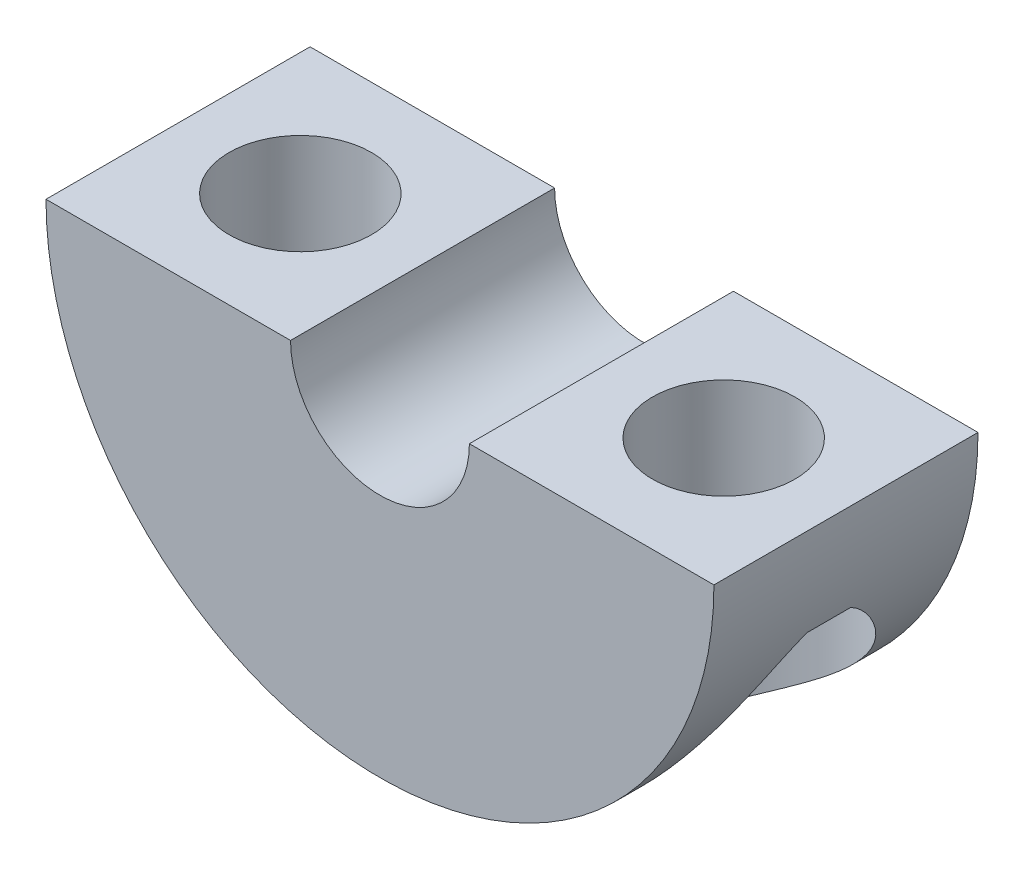
ISO-10303-21;
HEADER;
FILE_DESCRIPTION(('STEP AP214'),'2;1');
FILE_NAME('part.step','',(''),(''),'','','');
FILE_SCHEMA(('AUTOMOTIVE_DESIGN { 1 0 10303 214 1 1 1 1 }'));
ENDSEC;
DATA;
#1=APPLICATION_CONTEXT('core data for automotive mechanical design processes');
#2=APPLICATION_PROTOCOL_DEFINITION('international standard','automotive_design',2000,#1);
#3=PRODUCT_CONTEXT('',#1,'mechanical');
#4=PRODUCT('Part','Part','',(#3));
#5=PRODUCT_RELATED_PRODUCT_CATEGORY('part','',(#4));
#6=PRODUCT_DEFINITION_FORMATION('','',#4);
#7=PRODUCT_DEFINITION_CONTEXT('part definition',#1,'design');
#8=PRODUCT_DEFINITION('design','',#6,#7);
#9=PRODUCT_DEFINITION_SHAPE('','',#8);
#10=(LENGTH_UNIT() NAMED_UNIT(*) SI_UNIT(.MILLI.,.METRE.));
#11=(NAMED_UNIT(*) PLANE_ANGLE_UNIT() SI_UNIT($,.RADIAN.));
#12=(NAMED_UNIT(*) SI_UNIT($,.STERADIAN.) SOLID_ANGLE_UNIT());
#13=UNCERTAINTY_MEASURE_WITH_UNIT(LENGTH_MEASURE(1.E-05),#10,'distance_accuracy_value','');
#14=(GEOMETRIC_REPRESENTATION_CONTEXT(3) GLOBAL_UNCERTAINTY_ASSIGNED_CONTEXT((#13)) GLOBAL_UNIT_ASSIGNED_CONTEXT((#10,
#11,#12)) REPRESENTATION_CONTEXT('',''));
#15=CARTESIAN_POINT('',(0.,0.,0.));
#16=DIRECTION('',(0.,0.,1.));
#17=DIRECTION('',(1.,0.,0.));
#18=AXIS2_PLACEMENT_3D('',#15,#16,#17);
#19=CARTESIAN_POINT('',(0.,0.,5.99999999999999));
#20=DIRECTION('',(0.,0.,-1.));
#21=DIRECTION('',(-1.,0.,0.));
#22=AXIS2_PLACEMENT_3D('',#19,#20,#21);
#23=CYLINDRICAL_SURFACE('',#22,4.064);
#24=DIRECTION('',(0.,0.,-1.));
#25=VECTOR('',#24,1.);
#26=CARTESIAN_POINT('',(4.064,0.,5.99999999999999));
#27=LINE('',#26,#25);
#28=CARTESIAN_POINT('',(4.064,0.,5.99999999999999));
#29=VERTEX_POINT('',#28);
#30=CARTESIAN_POINT('',(4.064,0.,-5.99999999999999));
#31=VERTEX_POINT('',#30);
#32=EDGE_CURVE('E170',#29,#31,#27,.T.);
#33=ORIENTED_EDGE('',*,*,#32,.T.);
#34=CARTESIAN_POINT('',(0.,0.,-5.99999999999999));
#35=DIRECTION('',(0.,0.,-1.));
#36=DIRECTION('',(-1.,0.,0.));
#37=AXIS2_PLACEMENT_3D('',#34,#35,#36);
#38=CIRCLE('',#37,4.064);
#39=CARTESIAN_POINT('',(-4.064,0.,-5.99999999999999));
#40=VERTEX_POINT('',#39);
#41=EDGE_CURVE('E149',#31,#40,#38,.T.);
#42=ORIENTED_EDGE('',*,*,#41,.T.);
#43=DIRECTION('',(0.,0.,-1.));
#44=VECTOR('',#43,1.);
#45=CARTESIAN_POINT('',(-4.064,0.,5.99999999999999));
#46=LINE('',#45,#44);
#47=CARTESIAN_POINT('',(-4.064,0.,5.99999999999999));
#48=VERTEX_POINT('',#47);
#49=EDGE_CURVE('E134',#48,#40,#46,.T.);
#50=ORIENTED_EDGE('',*,*,#49,.F.);
#51=CARTESIAN_POINT('',(0.,0.,5.99999999999999));
#52=DIRECTION('',(0.,0.,-1.));
#53=DIRECTION('',(-1.,0.,0.));
#54=AXIS2_PLACEMENT_3D('',#51,#52,#53);
#55=CIRCLE('',#54,4.064);
#56=EDGE_CURVE('E158',#29,#48,#55,.T.);
#57=ORIENTED_EDGE('',*,*,#56,.F.);
#58=EDGE_LOOP('',(#33,#42,#50,#57));
#59=FACE_BOUND('',#58,.T.);
#60=ADVANCED_FACE('F51',(#59),#23,.F.);
#61=CARTESIAN_POINT('',(-4.064,0.,5.99999999999999));
#62=DIRECTION('',(0.,-1.,0.));
#63=DIRECTION('',(1.,0.,0.));
#64=AXIS2_PLACEMENT_3D('',#61,#62,#63);
#65=PLANE('',#64);
#66=CARTESIAN_POINT('',(-9.62025000000001,0.,0.));
#67=DIRECTION('',(0.,-1.,0.));
#68=DIRECTION('',(0.,0.,-1.));
#69=AXIS2_PLACEMENT_3D('',#66,#67,#68);
#70=CIRCLE('',#69,3.2385);
#71=CARTESIAN_POINT('',(-9.62025000000001,0.,-3.2385));
#72=VERTEX_POINT('',#71);
#73=EDGE_CURVE('E153',#72,#72,#70,.T.);
#74=ORIENTED_EDGE('',*,*,#73,.T.);
#75=EDGE_LOOP('',(#74));
#76=FACE_BOUND('',#75,.T.);
#77=ORIENTED_EDGE('',*,*,#49,.T.);
#78=DIRECTION('',(-1.,0.,0.));
#79=VECTOR('',#78,1.);
#80=CARTESIAN_POINT('',(-4.064,0.,-5.99999999999999));
#81=LINE('',#80,#79);
#82=CARTESIAN_POINT('',(-15.1765,0.,-5.99999999999999));
#83=VERTEX_POINT('',#82);
#84=EDGE_CURVE('E141',#40,#83,#81,.T.);
#85=ORIENTED_EDGE('',*,*,#84,.T.);
#86=DIRECTION('',(0.,0.,-1.));
#87=VECTOR('',#86,1.);
#88=CARTESIAN_POINT('',(-15.1765,0.,5.99999999999999));
#89=LINE('',#88,#87);
#90=CARTESIAN_POINT('',(-15.1765,0.,5.99999999999999));
#91=VERTEX_POINT('',#90);
#92=EDGE_CURVE('E126',#91,#83,#89,.T.);
#93=ORIENTED_EDGE('',*,*,#92,.F.);
#94=DIRECTION('',(-1.,0.,0.));
#95=VECTOR('',#94,1.);
#96=CARTESIAN_POINT('',(-4.064,0.,5.99999999999999));
#97=LINE('',#96,#95);
#98=EDGE_CURVE('E162',#48,#91,#97,.T.);
#99=ORIENTED_EDGE('',*,*,#98,.F.);
#100=EDGE_LOOP('',(#77,#85,#93,#99));
#101=FACE_BOUND('',#100,.T.);
#102=ADVANCED_FACE('F117',(#76,#101),#65,.F.);
#103=CARTESIAN_POINT('',(0.,0.,5.99999999999999));
#104=DIRECTION('',(0.,0.,-1.));
#105=DIRECTION('',(-1.,0.,0.));
#106=AXIS2_PLACEMENT_3D('',#103,#104,#105);
#107=CYLINDRICAL_SURFACE('',#106,15.1765);
#108=CARTESIAN_POINT('',(14.4098836220145,-4.7625,-0.983168356319863));
#109=CARTESIAN_POINT('',(14.395164484773,-4.80705726248078,-1.05478077029091));
#110=CARTESIAN_POINT('',(14.3792534040765,-4.85448653504706,-1.12423207210973));
#111=CARTESIAN_POINT('',(14.3453472689503,-4.95377148513815,-1.25918464987074));
#112=CARTESIAN_POINT('',(14.327355910217,-5.00561927117051,-1.32469262568911));
#113=CARTESIAN_POINT('',(14.2896356686427,-5.1123055094865,-1.45204051444744));
#114=CARTESIAN_POINT('',(14.2699164720865,-5.1671267061843,-1.51389798484691));
#115=CARTESIAN_POINT('',(14.2288091293247,-5.27927210536757,-1.6347683576263));
#116=CARTESIAN_POINT('',(14.2074201478121,-5.33659755420349,-1.69377981210253));
#117=CARTESIAN_POINT('',(14.1412209047339,-5.51065569604374,-1.86632877542624));
#118=CARTESIAN_POINT('',(14.0941328735286,-5.63017137019738,-1.97618796288012));
#119=CARTESIAN_POINT('',(13.9943232752456,-5.87388184660284,-2.18824632388299));
#120=CARTESIAN_POINT('',(13.9415915223291,-5.99808483794266,-2.29043106126169));
#121=CARTESIAN_POINT('',(13.8347861749667,-6.24027893974046,-2.48112008865326));
#122=CARTESIAN_POINT('',(13.7810811217235,-6.35807530775444,-2.57007980855318));
#123=CARTESIAN_POINT('',(13.6691821286037,-6.59521217066756,-2.74298224431728));
#124=CARTESIAN_POINT('',(13.6109875791737,-6.71455287340885,-2.82692427615799));
#125=CARTESIAN_POINT('',(13.4297650081427,-7.07385481503735,-3.07182867414429));
#126=CARTESIAN_POINT('',(13.3000611081176,-7.31518052192293,-3.22593448453456));
#127=CARTESIAN_POINT('',(13.022041041974,-7.79943333361932,-3.51793330267362));
#128=CARTESIAN_POINT('',(12.8736125021986,-8.04236092655021,-3.6557177705895));
#129=CARTESIAN_POINT('',(12.5586007354476,-8.52589603877453,-3.91339896855321));
#130=CARTESIAN_POINT('',(12.3920224052675,-8.76650416488276,-4.03330050282009));
#131=CARTESIAN_POINT('',(12.0758173197294,-9.19548171429187,-4.23141364384562));
#132=CARTESIAN_POINT('',(11.929487477476,-9.38465318892597,-4.31316411024673));
#133=CARTESIAN_POINT('',(11.6251467639545,-9.75911380591497,-4.46277383090333));
#134=CARTESIAN_POINT('',(11.4671358891527,-9.94440294709541,-4.53063308095661));
#135=CARTESIAN_POINT('',(11.1402944834824,-10.309206652172,-4.65046823185432));
#136=CARTESIAN_POINT('',(10.9715079078441,-10.4887406863649,-4.70250422342846));
#137=CARTESIAN_POINT('',(10.6231127192135,-10.8414484598177,-4.78891069163588));
#138=CARTESIAN_POINT('',(10.4435076252003,-11.0146242380649,-4.8232868782404));
#139=CARTESIAN_POINT('',(10.1228905427292,-11.3087304922951,-4.86553249044851));
#140=CARTESIAN_POINT('',(9.98411405001295,-11.4314492189769,-4.87798972747001));
#141=CARTESIAN_POINT('',(9.70183610042268,-11.6719699151452,-4.89085949689265));
#142=CARTESIAN_POINT('',(9.55833579954206,-11.7897730717849,-4.89127495449834));
#143=CARTESIAN_POINT('',(9.26746215613259,-12.0197615799611,-4.87892786914404));
#144=CARTESIAN_POINT('',(9.12008942949643,-12.1319478166966,-4.86616740954131));
#145=CARTESIAN_POINT('',(8.82259713288853,-12.3499762893108,-4.82633078685163));
#146=CARTESIAN_POINT('',(8.67247803388875,-12.4558195998629,-4.79925705652057));
#147=CARTESIAN_POINT('',(8.39727698646901,-12.6425682726042,-4.73580635610151));
#148=CARTESIAN_POINT('',(8.27239531317099,-12.7246031876383,-4.70187589610583));
#149=CARTESIAN_POINT('',(8.02278061260985,-12.8834395050943,-4.62303199092427));
#150=CARTESIAN_POINT('',(7.89804756120084,-12.9602419201769,-4.57812067865899));
#151=CARTESIAN_POINT('',(7.64988516916242,-13.1082524132526,-4.47692145043758));
#152=CARTESIAN_POINT('',(7.52645570279969,-13.1794610351229,-4.42063464241208));
#153=CARTESIAN_POINT('',(7.28224870984861,-13.3159514475083,-4.29647662680101));
#154=CARTESIAN_POINT('',(7.16146992113358,-13.3812361072834,-4.2286110737337));
#155=CARTESIAN_POINT('',(6.92314604513809,-13.5060880966911,-4.08076324736554));
#156=CARTESIAN_POINT('',(6.80562679680705,-13.565615892581,-4.00070574579243));
#157=CARTESIAN_POINT('',(6.57613968146382,-13.6783363706648,-3.82898661862926));
#158=CARTESIAN_POINT('',(6.46417192618094,-13.7315289253859,-3.73732475962179));
#159=CARTESIAN_POINT('',(6.24732246030128,-13.8315354808254,-3.54284877535115));
#160=CARTESIAN_POINT('',(6.14243955402728,-13.8783505592037,-3.4400365395549));
#161=CARTESIAN_POINT('',(5.9412106618051,-13.9656794376189,-3.22392190630984));
#162=CARTESIAN_POINT('',(5.84486376386136,-14.0061939111689,-3.11062063217168));
#163=CARTESIAN_POINT('',(5.67184896384001,-14.0770759668338,-2.88706263980843));
#164=CARTESIAN_POINT('',(5.59417845063421,-14.1080653620865,-2.77777656550619));
#165=CARTESIAN_POINT('',(5.44759905214751,-14.1653100746274,-2.55230696235792));
#166=CARTESIAN_POINT('',(5.3786897114885,-14.191565637995,-2.436123792462));
#167=CARTESIAN_POINT('',(5.25041525634876,-14.239521864619,-2.19774247667581));
#168=CARTESIAN_POINT('',(5.19104794884063,-14.2612235748303,-2.07554572133345));
#169=CARTESIAN_POINT('',(5.08248771757597,-14.3002727779914,-1.82604262705394));
#170=CARTESIAN_POINT('',(5.03329466969156,-14.3176203240634,-1.69873635047653));
#171=CARTESIAN_POINT('',(4.9475375875442,-14.3474734414835,-1.44569206269124));
#172=CARTESIAN_POINT('',(4.91051382981419,-14.3601581891287,-1.32013068369907));
#173=CARTESIAN_POINT('',(4.84659286122882,-14.3818577113414,-1.06609905147021));
#174=CARTESIAN_POINT('',(4.81969903647993,-14.3908712588281,-0.937627840757468));
#175=CARTESIAN_POINT('',(4.77632027210253,-14.4053267979399,-0.67879821555048));
#176=CARTESIAN_POINT('',(4.75983095928577,-14.4107702901563,-0.54844061753527));
#177=CARTESIAN_POINT('',(4.73739318715128,-14.4181620958185,-0.28667413121741));
#178=CARTESIAN_POINT('',(4.73144861853041,-14.4201091191747,-0.155264872839928));
#179=CARTESIAN_POINT('',(4.73017156753696,-14.4205280523385,0.106774895943486));
#180=CARTESIAN_POINT('',(4.73477190324198,-14.4190219620286,0.237405049701504));
#181=CARTESIAN_POINT('',(4.7544074839231,-14.4125593952278,0.497841376893624));
#182=CARTESIAN_POINT('',(4.76944655529856,-14.4076016535053,0.627647230561121));
#183=CARTESIAN_POINT('',(4.80981687624343,-14.3941747013029,0.885412243172995));
#184=CARTESIAN_POINT('',(4.83514410321579,-14.3857068632196,1.01337210366217));
#185=CARTESIAN_POINT('',(4.89586532038414,-14.3651551168879,1.26663447077679));
#186=CARTESIAN_POINT('',(4.9312630127695,-14.353069878695,1.39193598187953));
#187=CARTESIAN_POINT('',(5.01176703751594,-14.3251581422466,1.63888792225953));
#188=CARTESIAN_POINT('',(5.05686893367296,-14.3093333531749,1.76053999099402));
#189=CARTESIAN_POINT('',(5.15637321101362,-14.2737786868973,1.99944094192607));
#190=CARTESIAN_POINT('',(5.21077898839935,-14.2540473832774,2.11668819710174));
#191=CARTESIAN_POINT('',(5.32831676158442,-14.2105283166418,2.34586769412067));
#192=CARTESIAN_POINT('',(5.39144470512217,-14.1867424361636,2.4578023718942));
#193=CARTESIAN_POINT('',(5.52583598474605,-14.1349381520595,2.67570143347115));
#194=CARTESIAN_POINT('',(5.59710230850081,-14.1069181928392,2.78166360325696));
#195=CARTESIAN_POINT('',(5.74730500398243,-14.0463947869569,2.98726709602072));
#196=CARTESIAN_POINT('',(5.82626789070783,-14.0138756667066,3.08688446236518));
#197=CARTESIAN_POINT('',(5.99083516077464,-13.9443196342944,3.27880629094897));
#198=CARTESIAN_POINT('',(6.07644193236118,-13.9072810947953,3.37110809917616));
#199=CARTESIAN_POINT('',(6.34187583923303,-13.7892745832189,3.63618146045299));
#200=CARTESIAN_POINT('',(6.53046896425824,-13.7013560587016,3.79732716147685));
#201=CARTESIAN_POINT('',(6.92914290956408,-13.5042223868505,4.09001932649403));
#202=CARTESIAN_POINT('',(7.1397002039557,-13.3944449785012,4.22052667270957));
#203=CARTESIAN_POINT('',(7.56945340068927,-13.1563630928387,4.44525320331035));
#204=CARTESIAN_POINT('',(7.78865155497557,-13.028053762293,4.53946285809731));
#205=CARTESIAN_POINT('',(8.24941988295512,-12.7418019364269,4.70033057012684));
#206=CARTESIAN_POINT('',(8.49114959985036,-12.5822057597636,4.76355055429392));
#207=CARTESIAN_POINT('',(8.96952943849742,-12.2457884538698,4.85211782981077));
#208=CARTESIAN_POINT('',(9.20617571788367,-12.0689548184478,4.87743740236582));
#209=CARTESIAN_POINT('',(9.61227252023424,-11.7464981421957,4.89261602034581));
#210=CARTESIAN_POINT('',(9.7839364983761,-11.603893815944,4.88966415972664));
#211=CARTESIAN_POINT('',(10.1202240945263,-11.3117994983638,4.86678988986132));
#212=CARTESIAN_POINT('',(10.2848448667192,-11.1623067735057,4.84686068765496));
#213=CARTESIAN_POINT('',(10.6062541462737,-10.8573796731662,4.79183030147265));
#214=CARTESIAN_POINT('',(10.7630305416118,-10.7019367260346,4.75670641665362));
#215=CARTESIAN_POINT('',(11.0679105803283,-10.3863211140543,4.67295189071852));
#216=CARTESIAN_POINT('',(11.2160143299733,-10.2261485071947,4.62432141514186));
#217=CARTESIAN_POINT('',(11.555246770341,-9.84324114621807,4.49520002409382));
#218=CARTESIAN_POINT('',(11.7425473870395,-9.61884439093404,4.40954810066538));
#219=CARTESIAN_POINT('',(12.1002258963191,-9.16483925245157,4.21877280498687));
#220=CARTESIAN_POINT('',(12.2705960151685,-8.935228534132,4.11364055111857));
#221=CARTESIAN_POINT('',(12.5948216966769,-8.47211507709052,3.88568079767888));
#222=CARTESIAN_POINT('',(12.748631053192,-8.23860344687291,3.76280591924102));
#223=CARTESIAN_POINT('',(13.0393285054069,-7.77032377680799,3.50077544980914));
#224=CARTESIAN_POINT('',(13.1762228169298,-7.53555623176079,3.36162587613595));
#225=CARTESIAN_POINT('',(13.389028264888,-7.1477832192346,3.11768095924705));
#226=CARTESIAN_POINT('',(13.4697151099251,-6.99444020361095,3.01753967024466));
#227=CARTESIAN_POINT('',(13.6238743895405,-6.68920028645688,2.8097947406206));
#228=CARTESIAN_POINT('',(13.697347999863,-6.53730315290744,2.70219232104475));
#229=CARTESIAN_POINT('',(13.8365010005098,-6.23735024834287,2.4794294436969));
#230=CARTESIAN_POINT('',(13.9022312516993,-6.08927505573542,2.364327032828));
#231=CARTESIAN_POINT('',(14.0262300002922,-5.79793071933961,2.12434429165446));
#232=CARTESIAN_POINT('',(14.084500384738,-5.65466036691707,1.99946644706749));
#233=CARTESIAN_POINT('',(14.1658412729101,-5.44616357726991,1.80272686487828));
#234=CARTESIAN_POINT('',(14.1919539291111,-5.37770503620276,1.73554597327311));
#235=CARTESIAN_POINT('',(14.2419767446448,-5.24379181913095,1.59757170326906));
#236=CARTESIAN_POINT('',(14.2658887528711,-5.17833464513909,1.5267814364896));
#237=CARTESIAN_POINT('',(14.311488238086,-5.05094358139387,1.38037692410241));
#238=CARTESIAN_POINT('',(14.3331581020849,-4.98903907327021,1.30473108927157));
#239=CARTESIAN_POINT('',(14.3737248230336,-4.87095495817839,1.14811112009265));
#240=CARTESIAN_POINT('',(14.3926144365979,-4.81479041783316,1.06712383681542));
#241=CARTESIAN_POINT('',(14.4098836220145,-4.7625,0.983168356319868));
#242=B_SPLINE_CURVE_WITH_KNOTS('',3,(#108,#109,#110,#111,#112,#113,#114,#115,#116,#117,#118,
#119,#120,#121,#122,#123,#124,#125,#126,#127,#128,#129,#130,#131,#132,#133,#134,#135,#136,#137,
#138,#139,#140,#141,#142,#143,#144,#145,#146,#147,#148,#149,#150,#151,#152,#153,#154,#155,#156,
#157,#158,#159,#160,#161,#162,#163,#164,#165,#166,#167,#168,#169,#170,#171,#172,#173,#174,#175,
#176,#177,#178,#179,#180,#181,#182,#183,#184,#185,#186,#187,#188,#189,#190,#191,#192,#193,#194,
#195,#196,#197,#198,#199,#200,#201,#202,#203,#204,#205,#206,#207,#208,#209,#210,#211,#212,#213,
#214,#215,#216,#217,#218,#219,#220,#221,#222,#223,#224,#225,#226,#227,#228,#229,#230,#231,#232,
#233,#234,#235,#236,#237,#238,#239,#240,#241),.UNSPECIFIED.,.F.,.F.,(4,2,2,2,2,2,2,2,2,2,2,2,2,
2,2,2,2,2,2,2,2,2,2,2,2,2,2,2,2,2,2,2,2,2,2,2,2,2,2,2,2,2,2,2,2,2,2,2,2,2,2,2,2,2,2,2,2,2,2,2,2,
2,2,2,2,2,4),(0.,0.2566130534345,0.512777032259552,0.76758705831936,1.02252537965409,
1.52912241128305,2.03664968453878,2.50771645514673,2.9788472969596,3.92077099473118,
4.86864347823367,5.81626085698213,6.57389590712053,7.33153118644977,8.08625224916187,
8.84072913294965,9.39728767340071,9.95371101280207,10.510046384809,11.0662872296273,
11.5255028235799,11.9846292902651,12.4437110612857,12.902569276594,13.3643829968596,
13.826206007816,14.2879508833024,14.7496463658685,15.1619573090216,15.5742468127833,
15.9864414249167,16.3986310079016,16.7927197583405,17.1869401231482,17.5809946800542,
17.9751946011471,18.3668900479936,18.7587291497152,19.1504151923242,19.5422454163432,
19.9338968972455,20.3256916493198,20.7173049843739,21.1090625489994,21.5022209426444,
21.8955213235154,22.6813418792537,23.4908592361411,24.3005889791812,25.1867155230795,
26.0734898272076,26.7421930669615,27.4111639934531,28.0811378323438,28.7511034602665,
29.6635444069084,30.5764023886735,31.4917447093772,32.4067496597444,33.0069108524868,
33.6069740570568,34.2028455512763,34.7985660151919,35.0966797851281,35.3945407609423,
35.6945876496456,35.9954029155575),.UNSPECIFIED.);
#243=CARTESIAN_POINT('',(14.4098836220145,-4.7625,-0.983168356319863));
#244=VERTEX_POINT('',#243);
#245=CARTESIAN_POINT('',(14.4098836220145,-4.7625,0.983168356319863));
#246=VERTEX_POINT('',#245);
#247=EDGE_CURVE('E58',#244,#246,#242,.T.);
#248=ORIENTED_EDGE('',*,*,#247,.T.);
#249=DIRECTION('',(0.,0.,-1.));
#250=VECTOR('',#249,1.);
#251=CARTESIAN_POINT('',(14.4098836220145,-4.7625,5.99999999999999));
#252=LINE('',#251,#250);
#253=EDGE_CURVE('E13',#246,#244,#252,.T.);
#254=ORIENTED_EDGE('',*,*,#253,.T.);
#255=EDGE_LOOP('',(#248,#254));
#256=FACE_BOUND('',#255,.T.);
#257=CARTESIAN_POINT('',(-14.4098836220145,-4.7625,0.983168356319863));
#258=CARTESIAN_POINT('',(-14.395164484773,-4.80705726248078,1.05478077029091));
#259=CARTESIAN_POINT('',(-14.3792534040765,-4.85448653504706,1.12423207210973));
#260=CARTESIAN_POINT('',(-14.3453472689503,-4.95377148513815,1.25918464987074));
#261=CARTESIAN_POINT('',(-14.327355910217,-5.00561927117051,1.32469262568911));
#262=CARTESIAN_POINT('',(-14.2896356686427,-5.1123055094865,1.45204051444744));
#263=CARTESIAN_POINT('',(-14.2699164720865,-5.1671267061843,1.51389798484691));
#264=CARTESIAN_POINT('',(-14.2288091293247,-5.27927210536757,1.6347683576263));
#265=CARTESIAN_POINT('',(-14.2074201478121,-5.33659755420349,1.69377981210253));
#266=CARTESIAN_POINT('',(-14.1412209047339,-5.51065569604374,1.86632877542624));
#267=CARTESIAN_POINT('',(-14.0941328735286,-5.63017137019738,1.97618796288012));
#268=CARTESIAN_POINT('',(-13.9943232752456,-5.87388184660284,2.18824632388299));
#269=CARTESIAN_POINT('',(-13.9415915223291,-5.99808483794266,2.29043106126169));
#270=CARTESIAN_POINT('',(-13.8347861749667,-6.24027893974046,2.48112008865326));
#271=CARTESIAN_POINT('',(-13.7810811217235,-6.35807530775444,2.57007980855318));
#272=CARTESIAN_POINT('',(-13.6691821286037,-6.59521217066756,2.74298224431728));
#273=CARTESIAN_POINT('',(-13.6109875791737,-6.71455287340885,2.82692427615799));
#274=CARTESIAN_POINT('',(-13.4297650081427,-7.07385481503735,3.07182867414429));
#275=CARTESIAN_POINT('',(-13.3000611081176,-7.31518052192293,3.22593448453456));
#276=CARTESIAN_POINT('',(-13.022041041974,-7.79943333361932,3.51793330267362));
#277=CARTESIAN_POINT('',(-12.8736125021986,-8.04236092655021,3.6557177705895));
#278=CARTESIAN_POINT('',(-12.5586007354476,-8.52589603877453,3.91339896855321));
#279=CARTESIAN_POINT('',(-12.3920224052675,-8.76650416488276,4.03330050282009));
#280=CARTESIAN_POINT('',(-12.0758173197294,-9.19548171429187,4.23141364384562));
#281=CARTESIAN_POINT('',(-11.929487477476,-9.38465318892597,4.31316411024673));
#282=CARTESIAN_POINT('',(-11.6251467639545,-9.75911380591497,4.46277383090333));
#283=CARTESIAN_POINT('',(-11.4671358891527,-9.94440294709541,4.53063308095661));
#284=CARTESIAN_POINT('',(-11.1402944834824,-10.309206652172,4.65046823185432));
#285=CARTESIAN_POINT('',(-10.9715079078441,-10.4887406863649,4.70250422342846));
#286=CARTESIAN_POINT('',(-10.6231127192135,-10.8414484598177,4.78891069163588));
#287=CARTESIAN_POINT('',(-10.4435076252003,-11.0146242380649,4.8232868782404));
#288=CARTESIAN_POINT('',(-10.1228905427292,-11.3087304922951,4.86553249044851));
#289=CARTESIAN_POINT('',(-9.98411405001295,-11.4314492189769,4.87798972747001));
#290=CARTESIAN_POINT('',(-9.70183610042268,-11.6719699151452,4.89085949689265));
#291=CARTESIAN_POINT('',(-9.55833579954206,-11.7897730717849,4.89127495449834));
#292=CARTESIAN_POINT('',(-9.26746215613259,-12.0197615799611,4.87892786914404));
#293=CARTESIAN_POINT('',(-9.12008942949643,-12.1319478166966,4.86616740954131));
#294=CARTESIAN_POINT('',(-8.82259713288853,-12.3499762893108,4.82633078685163));
#295=CARTESIAN_POINT('',(-8.67247803388875,-12.4558195998629,4.79925705652057));
#296=CARTESIAN_POINT('',(-8.39727698646901,-12.6425682726042,4.73580635610151));
#297=CARTESIAN_POINT('',(-8.27239531317099,-12.7246031876383,4.70187589610583));
#298=CARTESIAN_POINT('',(-8.02278061260985,-12.8834395050943,4.62303199092427));
#299=CARTESIAN_POINT('',(-7.89804756120084,-12.9602419201769,4.57812067865899));
#300=CARTESIAN_POINT('',(-7.64988516916242,-13.1082524132526,4.47692145043758));
#301=CARTESIAN_POINT('',(-7.52645570279969,-13.1794610351229,4.42063464241208));
#302=CARTESIAN_POINT('',(-7.28224870984861,-13.3159514475083,4.29647662680101));
#303=CARTESIAN_POINT('',(-7.16146992113358,-13.3812361072834,4.2286110737337));
#304=CARTESIAN_POINT('',(-6.92314604513809,-13.5060880966911,4.08076324736554));
#305=CARTESIAN_POINT('',(-6.80562679680705,-13.565615892581,4.00070574579243));
#306=CARTESIAN_POINT('',(-6.57613968146382,-13.6783363706648,3.82898661862926));
#307=CARTESIAN_POINT('',(-6.46417192618094,-13.7315289253859,3.73732475962179));
#308=CARTESIAN_POINT('',(-6.24732246030128,-13.8315354808254,3.54284877535115));
#309=CARTESIAN_POINT('',(-6.14243955402728,-13.8783505592037,3.4400365395549));
#310=CARTESIAN_POINT('',(-5.9412106618051,-13.9656794376189,3.22392190630984));
#311=CARTESIAN_POINT('',(-5.84486376386136,-14.0061939111689,3.11062063217168));
#312=CARTESIAN_POINT('',(-5.67184896384001,-14.0770759668338,2.88706263980843));
#313=CARTESIAN_POINT('',(-5.59417845063421,-14.1080653620865,2.77777656550619));
#314=CARTESIAN_POINT('',(-5.44759905214751,-14.1653100746274,2.55230696235792));
#315=CARTESIAN_POINT('',(-5.3786897114885,-14.191565637995,2.436123792462));
#316=CARTESIAN_POINT('',(-5.25041525634876,-14.239521864619,2.19774247667581));
#317=CARTESIAN_POINT('',(-5.19104794884063,-14.2612235748303,2.07554572133345));
#318=CARTESIAN_POINT('',(-5.08248771757597,-14.3002727779914,1.82604262705394));
#319=CARTESIAN_POINT('',(-5.03329466969156,-14.3176203240634,1.69873635047653));
#320=CARTESIAN_POINT('',(-4.9475375875442,-14.3474734414835,1.44569206269124));
#321=CARTESIAN_POINT('',(-4.91051382981419,-14.3601581891287,1.32013068369907));
#322=CARTESIAN_POINT('',(-4.84659286122882,-14.3818577113414,1.06609905147021));
#323=CARTESIAN_POINT('',(-4.81969903647993,-14.3908712588281,0.937627840757468));
#324=CARTESIAN_POINT('',(-4.77632027210253,-14.4053267979399,0.67879821555048));
#325=CARTESIAN_POINT('',(-4.75983095928577,-14.4107702901563,0.54844061753527));
#326=CARTESIAN_POINT('',(-4.73739318715128,-14.4181620958185,0.28667413121741));
#327=CARTESIAN_POINT('',(-4.73144861853041,-14.4201091191747,0.155264872839928));
#328=CARTESIAN_POINT('',(-4.73017156753696,-14.4205280523385,-0.106774895943486));
#329=CARTESIAN_POINT('',(-4.73477190324198,-14.4190219620286,-0.237405049701504));
#330=CARTESIAN_POINT('',(-4.7544074839231,-14.4125593952278,-0.497841376893624));
#331=CARTESIAN_POINT('',(-4.76944655529856,-14.4076016535053,-0.627647230561121));
#332=CARTESIAN_POINT('',(-4.80981687624343,-14.3941747013029,-0.885412243172995));
#333=CARTESIAN_POINT('',(-4.83514410321579,-14.3857068632196,-1.01337210366217));
#334=CARTESIAN_POINT('',(-4.89586532038414,-14.3651551168879,-1.26663447077679));
#335=CARTESIAN_POINT('',(-4.9312630127695,-14.353069878695,-1.39193598187953));
#336=CARTESIAN_POINT('',(-5.01176703751594,-14.3251581422466,-1.63888792225953));
#337=CARTESIAN_POINT('',(-5.05686893367296,-14.3093333531749,-1.76053999099402));
#338=CARTESIAN_POINT('',(-5.15637321101362,-14.2737786868973,-1.99944094192607));
#339=CARTESIAN_POINT('',(-5.21077898839935,-14.2540473832774,-2.11668819710174));
#340=CARTESIAN_POINT('',(-5.32831676158442,-14.2105283166418,-2.34586769412067));
#341=CARTESIAN_POINT('',(-5.39144470512217,-14.1867424361636,-2.4578023718942));
#342=CARTESIAN_POINT('',(-5.52583598474605,-14.1349381520595,-2.67570143347115));
#343=CARTESIAN_POINT('',(-5.59710230850081,-14.1069181928392,-2.78166360325696));
#344=CARTESIAN_POINT('',(-5.74730500398243,-14.0463947869569,-2.98726709602072));
#345=CARTESIAN_POINT('',(-5.82626789070783,-14.0138756667066,-3.08688446236518));
#346=CARTESIAN_POINT('',(-5.99083516077464,-13.9443196342944,-3.27880629094897));
#347=CARTESIAN_POINT('',(-6.07644193236118,-13.9072810947953,-3.37110809917616));
#348=CARTESIAN_POINT('',(-6.34187583923303,-13.7892745832189,-3.63618146045299));
#349=CARTESIAN_POINT('',(-6.53046896425824,-13.7013560587016,-3.79732716147685));
#350=CARTESIAN_POINT('',(-6.92914290956408,-13.5042223868505,-4.09001932649403));
#351=CARTESIAN_POINT('',(-7.1397002039557,-13.3944449785012,-4.22052667270957));
#352=CARTESIAN_POINT('',(-7.56945340068927,-13.1563630928387,-4.44525320331035));
#353=CARTESIAN_POINT('',(-7.78865155497557,-13.028053762293,-4.53946285809731));
#354=CARTESIAN_POINT('',(-8.24941988295512,-12.7418019364269,-4.70033057012684));
#355=CARTESIAN_POINT('',(-8.49114959985036,-12.5822057597636,-4.76355055429392));
#356=CARTESIAN_POINT('',(-8.96952943849742,-12.2457884538698,-4.85211782981077));
#357=CARTESIAN_POINT('',(-9.20617571788367,-12.0689548184478,-4.87743740236582));
#358=CARTESIAN_POINT('',(-9.61227252023424,-11.7464981421957,-4.89261602034581));
#359=CARTESIAN_POINT('',(-9.7839364983761,-11.603893815944,-4.88966415972664));
#360=CARTESIAN_POINT('',(-10.1202240945263,-11.3117994983638,-4.86678988986132));
#361=CARTESIAN_POINT('',(-10.2848448667192,-11.1623067735057,-4.84686068765496));
#362=CARTESIAN_POINT('',(-10.6062541462737,-10.8573796731662,-4.79183030147265));
#363=CARTESIAN_POINT('',(-10.7630305416118,-10.7019367260346,-4.75670641665362));
#364=CARTESIAN_POINT('',(-11.0679105803283,-10.3863211140543,-4.67295189071852));
#365=CARTESIAN_POINT('',(-11.2160143299733,-10.2261485071947,-4.62432141514186));
#366=CARTESIAN_POINT('',(-11.555246770341,-9.84324114621807,-4.49520002409382));
#367=CARTESIAN_POINT('',(-11.7425473870395,-9.61884439093404,-4.40954810066538));
#368=CARTESIAN_POINT('',(-12.1002258963191,-9.16483925245157,-4.21877280498687));
#369=CARTESIAN_POINT('',(-12.2705960151685,-8.935228534132,-4.11364055111857));
#370=CARTESIAN_POINT('',(-12.5948216966769,-8.47211507709052,-3.88568079767888));
#371=CARTESIAN_POINT('',(-12.748631053192,-8.23860344687291,-3.76280591924102));
#372=CARTESIAN_POINT('',(-13.0393285054069,-7.77032377680799,-3.50077544980914));
#373=CARTESIAN_POINT('',(-13.1762228169298,-7.53555623176079,-3.36162587613595));
#374=CARTESIAN_POINT('',(-13.389028264888,-7.1477832192346,-3.11768095924705));
#375=CARTESIAN_POINT('',(-13.4697151099251,-6.99444020361095,-3.01753967024466));
#376=CARTESIAN_POINT('',(-13.6238743895405,-6.68920028645688,-2.8097947406206));
#377=CARTESIAN_POINT('',(-13.697347999863,-6.53730315290744,-2.70219232104475));
#378=CARTESIAN_POINT('',(-13.8365010005098,-6.23735024834287,-2.4794294436969));
#379=CARTESIAN_POINT('',(-13.9022312516993,-6.08927505573542,-2.364327032828));
#380=CARTESIAN_POINT('',(-14.0262300002922,-5.79793071933961,-2.12434429165446));
#381=CARTESIAN_POINT('',(-14.084500384738,-5.65466036691707,-1.99946644706749));
#382=CARTESIAN_POINT('',(-14.1658412729101,-5.44616357726991,-1.80272686487828));
#383=CARTESIAN_POINT('',(-14.1919539291111,-5.37770503620276,-1.73554597327311));
#384=CARTESIAN_POINT('',(-14.2419767446448,-5.24379181913095,-1.59757170326906));
#385=CARTESIAN_POINT('',(-14.2658887528711,-5.17833464513909,-1.5267814364896));
#386=CARTESIAN_POINT('',(-14.311488238086,-5.05094358139387,-1.38037692410241));
#387=CARTESIAN_POINT('',(-14.3331581020849,-4.98903907327021,-1.30473108927157));
#388=CARTESIAN_POINT('',(-14.3737248230336,-4.87095495817839,-1.14811112009265));
#389=CARTESIAN_POINT('',(-14.3926144365979,-4.81479041783316,-1.06712383681542));
#390=CARTESIAN_POINT('',(-14.4098836220145,-4.7625,-0.983168356319868));
#391=B_SPLINE_CURVE_WITH_KNOTS('',3,(#257,#258,#259,#260,#261,#262,#263,#264,#265,#266,#267,
#268,#269,#270,#271,#272,#273,#274,#275,#276,#277,#278,#279,#280,#281,#282,#283,#284,#285,#286,
#287,#288,#289,#290,#291,#292,#293,#294,#295,#296,#297,#298,#299,#300,#301,#302,#303,#304,#305,
#306,#307,#308,#309,#310,#311,#312,#313,#314,#315,#316,#317,#318,#319,#320,#321,#322,#323,#324,
#325,#326,#327,#328,#329,#330,#331,#332,#333,#334,#335,#336,#337,#338,#339,#340,#341,#342,#343,
#344,#345,#346,#347,#348,#349,#350,#351,#352,#353,#354,#355,#356,#357,#358,#359,#360,#361,#362,
#363,#364,#365,#366,#367,#368,#369,#370,#371,#372,#373,#374,#375,#376,#377,#378,#379,#380,#381,
#382,#383,#384,#385,#386,#387,#388,#389,#390),.UNSPECIFIED.,.F.,.F.,(4,2,2,2,2,2,2,2,2,2,2,2,2,
2,2,2,2,2,2,2,2,2,2,2,2,2,2,2,2,2,2,2,2,2,2,2,2,2,2,2,2,2,2,2,2,2,2,2,2,2,2,2,2,2,2,2,2,2,2,2,2,
2,2,2,2,2,4),(0.,0.2566130534345,0.512777032259552,0.76758705831936,1.02252537965409,
1.52912241128305,2.03664968453878,2.50771645514673,2.9788472969596,3.92077099473118,
4.86864347823367,5.81626085698213,6.57389590712053,7.33153118644977,8.08625224916187,
8.84072913294965,9.39728767340071,9.95371101280207,10.510046384809,11.0662872296273,
11.5255028235799,11.9846292902651,12.4437110612857,12.902569276594,13.3643829968596,
13.826206007816,14.2879508833024,14.7496463658685,15.1619573090216,15.5742468127833,
15.9864414249167,16.3986310079016,16.7927197583405,17.1869401231482,17.5809946800542,
17.9751946011471,18.3668900479936,18.7587291497152,19.1504151923242,19.5422454163432,
19.9338968972455,20.3256916493198,20.7173049843739,21.1090625489994,21.5022209426444,
21.8955213235154,22.6813418792537,23.4908592361411,24.3005889791812,25.1867155230795,
26.0734898272076,26.7421930669615,27.4111639934531,28.0811378323438,28.7511034602665,
29.6635444069084,30.5764023886735,31.4917447093772,32.4067496597444,33.0069108524868,
33.6069740570568,34.2028455512763,34.7985660151919,35.0966797851281,35.3945407609423,
35.6945876496456,35.9954029155575),.UNSPECIFIED.);
#392=CARTESIAN_POINT('',(-14.4098836220145,-4.7625,0.983168356319863));
#393=VERTEX_POINT('',#392);
#394=CARTESIAN_POINT('',(-14.4098836220145,-4.7625,-0.983168356319863));
#395=VERTEX_POINT('',#394);
#396=EDGE_CURVE('E122',#393,#395,#391,.T.);
#397=ORIENTED_EDGE('',*,*,#396,.T.);
#398=DIRECTION('',(0.,0.,-1.));
#399=VECTOR('',#398,1.);
#400=CARTESIAN_POINT('',(-14.4098836220145,-4.7625,5.99999999999999));
#401=LINE('',#400,#399);
#402=EDGE_CURVE('E107',#395,#393,#401,.F.);
#403=ORIENTED_EDGE('',*,*,#402,.T.);
#404=EDGE_LOOP('',(#397,#403));
#405=FACE_BOUND('',#404,.T.);
#406=ORIENTED_EDGE('',*,*,#92,.T.);
#407=CARTESIAN_POINT('',(0.,0.,-5.99999999999999));
#408=DIRECTION('',(0.,0.,1.));
#409=DIRECTION('',(-1.,0.,0.));
#410=AXIS2_PLACEMENT_3D('',#407,#408,#409);
#411=CIRCLE('',#410,15.1765);
#412=CARTESIAN_POINT('',(15.1765,0.,-5.99999999999999));
#413=VERTEX_POINT('',#412);
#414=EDGE_CURVE('E129',#83,#413,#411,.T.);
#415=ORIENTED_EDGE('',*,*,#414,.T.);
#416=DIRECTION('',(0.,0.,-1.));
#417=VECTOR('',#416,1.);
#418=CARTESIAN_POINT('',(15.1765,0.,5.99999999999999));
#419=LINE('',#418,#417);
#420=CARTESIAN_POINT('',(15.1765,0.,5.99999999999999));
#421=VERTEX_POINT('',#420);
#422=EDGE_CURVE('E135',#421,#413,#419,.T.);
#423=ORIENTED_EDGE('',*,*,#422,.F.);
#424=CARTESIAN_POINT('',(0.,0.,5.99999999999999));
#425=DIRECTION('',(0.,0.,1.));
#426=DIRECTION('',(-1.,0.,0.));
#427=AXIS2_PLACEMENT_3D('',#424,#425,#426);
#428=CIRCLE('',#427,15.1765);
#429=EDGE_CURVE('E131',#91,#421,#428,.T.);
#430=ORIENTED_EDGE('',*,*,#429,.F.);
#431=EDGE_LOOP('',(#406,#415,#423,#430));
#432=FACE_BOUND('',#431,.T.);
#433=ADVANCED_FACE('F113',(#256,#405,#432),#107,.T.);
#434=CARTESIAN_POINT('',(15.1765,0.,5.99999999999999));
#435=DIRECTION('',(0.,-1.,0.));
#436=DIRECTION('',(1.,0.,0.));
#437=AXIS2_PLACEMENT_3D('',#434,#435,#436);
#438=PLANE('',#437);
#439=CARTESIAN_POINT('',(9.62025000000001,0.,0.));
#440=DIRECTION('',(0.,1.,0.));
#441=DIRECTION('',(0.,0.,-1.));
#442=AXIS2_PLACEMENT_3D('',#439,#440,#441);
#443=CIRCLE('',#442,3.2385);
#444=CARTESIAN_POINT('',(9.62025000000001,0.,-3.2385));
#445=VERTEX_POINT('',#444);
#446=EDGE_CURVE('E231',#445,#445,#443,.T.);
#447=ORIENTED_EDGE('',*,*,#446,.F.);
#448=EDGE_LOOP('',(#447));
#449=FACE_BOUND('',#448,.T.);
#450=ORIENTED_EDGE('',*,*,#422,.T.);
#451=DIRECTION('',(-1.,0.,0.));
#452=VECTOR('',#451,1.);
#453=CARTESIAN_POINT('',(15.1765,0.,-5.99999999999999));
#454=LINE('',#453,#452);
#455=EDGE_CURVE('E144',#413,#31,#454,.T.);
#456=ORIENTED_EDGE('',*,*,#455,.T.);
#457=ORIENTED_EDGE('',*,*,#32,.F.);
#458=DIRECTION('',(-1.,0.,0.));
#459=VECTOR('',#458,1.);
#460=CARTESIAN_POINT('',(15.1765,0.,5.99999999999999));
#461=LINE('',#460,#459);
#462=EDGE_CURVE('E167',#421,#29,#461,.T.);
#463=ORIENTED_EDGE('',*,*,#462,.F.);
#464=EDGE_LOOP('',(#450,#456,#457,#463));
#465=FACE_BOUND('',#464,.T.);
#466=ADVANCED_FACE('F116',(#449,#465),#438,.F.);
#467=CARTESIAN_POINT('',(0.,0.,5.99999999999999));
#468=DIRECTION('',(0.,0.,-1.));
#469=DIRECTION('',(-1.,0.,0.));
#470=AXIS2_PLACEMENT_3D('',#467,#468,#469);
#471=PLANE('',#470);
#472=ORIENTED_EDGE('',*,*,#56,.T.);
#473=ORIENTED_EDGE('',*,*,#98,.T.);
#474=ORIENTED_EDGE('',*,*,#429,.T.);
#475=ORIENTED_EDGE('',*,*,#462,.T.);
#476=EDGE_LOOP('',(#472,#473,#474,#475));
#477=FACE_BOUND('',#476,.T.);
#478=ADVANCED_FACE('F202',(#477),#471,.F.);
#479=CARTESIAN_POINT('',(0.,0.,-5.99999999999999));
#480=DIRECTION('',(0.,0.,-1.));
#481=DIRECTION('',(-1.,0.,0.));
#482=AXIS2_PLACEMENT_3D('',#479,#480,#481);
#483=PLANE('',#482);
#484=ORIENTED_EDGE('',*,*,#41,.F.);
#485=ORIENTED_EDGE('',*,*,#455,.F.);
#486=ORIENTED_EDGE('',*,*,#414,.F.);
#487=ORIENTED_EDGE('',*,*,#84,.F.);
#488=EDGE_LOOP('',(#484,#485,#486,#487));
#489=FACE_BOUND('',#488,.T.);
#490=ADVANCED_FACE('F140',(#489),#483,.T.);
#491=CARTESIAN_POINT('',(-6.38175000000001,-4.7625,0.));
#492=DIRECTION('',(0.,1.,0.));
#493=DIRECTION('',(0.,0.,1.));
#494=AXIS2_PLACEMENT_3D('',#491,#492,#493);
#495=PLANE('',#494);
#496=CARTESIAN_POINT('',(-9.62025000000001,-4.7625,0.));
#497=DIRECTION('',(0.,-1.,0.));
#498=DIRECTION('',(0.,0.,-1.));
#499=AXIS2_PLACEMENT_3D('',#496,#497,#498);
#500=CIRCLE('',#499,3.2385);
#501=CARTESIAN_POINT('',(-9.62025000000001,-4.7625,-3.2385));
#502=VERTEX_POINT('',#501);
#503=EDGE_CURVE('E224',#502,#502,#500,.T.);
#504=ORIENTED_EDGE('',*,*,#503,.F.);
#505=EDGE_LOOP('',(#504));
#506=FACE_BOUND('',#505,.T.);
#507=CARTESIAN_POINT('',(-9.62025000000001,-4.7625,0.));
#508=DIRECTION('',(0.,-1.,0.));
#509=DIRECTION('',(0.,0.,-1.));
#510=AXIS2_PLACEMENT_3D('',#507,#508,#509);
#511=CIRCLE('',#510,4.8895);
#512=EDGE_CURVE('E71',#395,#393,#511,.T.);
#513=ORIENTED_EDGE('',*,*,#512,.T.);
#514=ORIENTED_EDGE('',*,*,#402,.F.);
#515=EDGE_LOOP('',(#513,#514));
#516=FACE_BOUND('',#515,.T.);
#517=ADVANCED_FACE('F191',(#506,#516),#495,.F.);
#518=CARTESIAN_POINT('',(-9.62025000000001,-14.4203383000365,0.));
#519=DIRECTION('',(0.,-1.,0.));
#520=DIRECTION('',(0.,0.,-1.));
#521=AXIS2_PLACEMENT_3D('',#518,#519,#520);
#522=CYLINDRICAL_SURFACE('',#521,4.8895);
#523=ORIENTED_EDGE('',*,*,#512,.F.);
#524=ORIENTED_EDGE('',*,*,#396,.F.);
#525=EDGE_LOOP('',(#523,#524));
#526=FACE_BOUND('',#525,.T.);
#527=ADVANCED_FACE('F185',(#526),#522,.F.);
#528=CARTESIAN_POINT('',(-9.62025000000001,-14.4203383000365,0.));
#529=DIRECTION('',(0.,-1.,0.));
#530=DIRECTION('',(0.,0.,-1.));
#531=AXIS2_PLACEMENT_3D('',#528,#529,#530);
#532=CYLINDRICAL_SURFACE('',#531,3.2385);
#533=ORIENTED_EDGE('',*,*,#73,.F.);
#534=EDGE_LOOP('',(#533));
#535=FACE_BOUND('',#534,.T.);
#536=ORIENTED_EDGE('',*,*,#503,.T.);
#537=EDGE_LOOP('',(#536));
#538=FACE_BOUND('',#537,.T.);
#539=ADVANCED_FACE('F190',(#535,#538),#532,.F.);
#540=CARTESIAN_POINT('',(6.38175000000001,-4.7625,0.));
#541=DIRECTION('',(0.,1.,0.));
#542=DIRECTION('',(0.,0.,1.));
#543=AXIS2_PLACEMENT_3D('',#540,#541,#542);
#544=PLANE('',#543);
#545=CARTESIAN_POINT('',(9.62025000000001,-4.7625,0.));
#546=DIRECTION('',(0.,1.,0.));
#547=DIRECTION('',(0.,0.,-1.));
#548=AXIS2_PLACEMENT_3D('',#545,#546,#547);
#549=CIRCLE('',#548,3.2385);
#550=CARTESIAN_POINT('',(9.62025000000001,-4.7625,-3.2385));
#551=VERTEX_POINT('',#550);
#552=EDGE_CURVE('E111',#551,#551,#549,.T.);
#553=ORIENTED_EDGE('',*,*,#552,.T.);
#554=EDGE_LOOP('',(#553));
#555=FACE_BOUND('',#554,.T.);
#556=CARTESIAN_POINT('',(9.62025000000001,-4.7625,0.));
#557=DIRECTION('',(0.,1.,0.));
#558=DIRECTION('',(0.,0.,-1.));
#559=AXIS2_PLACEMENT_3D('',#556,#557,#558);
#560=CIRCLE('',#559,4.8895);
#561=EDGE_CURVE('E64',#244,#246,#560,.T.);
#562=ORIENTED_EDGE('',*,*,#561,.F.);
#563=ORIENTED_EDGE('',*,*,#253,.F.);
#564=EDGE_LOOP('',(#562,#563));
#565=FACE_BOUND('',#564,.T.);
#566=ADVANCED_FACE('F109',(#555,#565),#544,.F.);
#567=CARTESIAN_POINT('',(9.62025000000001,-14.4203383000365,0.));
#568=DIRECTION('',(0.,-1.,0.));
#569=DIRECTION('',(0.,0.,-1.));
#570=AXIS2_PLACEMENT_3D('',#567,#568,#569);
#571=CYLINDRICAL_SURFACE('',#570,4.8895);
#572=ORIENTED_EDGE('',*,*,#561,.T.);
#573=ORIENTED_EDGE('',*,*,#247,.F.);
#574=EDGE_LOOP('',(#572,#573));
#575=FACE_BOUND('',#574,.T.);
#576=ADVANCED_FACE('F104',(#575),#571,.F.);
#577=CARTESIAN_POINT('',(9.62025000000001,-14.4203383000365,0.));
#578=DIRECTION('',(0.,-1.,0.));
#579=DIRECTION('',(0.,0.,-1.));
#580=AXIS2_PLACEMENT_3D('',#577,#578,#579);
#581=CYLINDRICAL_SURFACE('',#580,3.2385);
#582=ORIENTED_EDGE('',*,*,#446,.T.);
#583=EDGE_LOOP('',(#582));
#584=FACE_BOUND('',#583,.T.);
#585=ORIENTED_EDGE('',*,*,#552,.F.);
#586=EDGE_LOOP('',(#585));
#587=FACE_BOUND('',#586,.T.);
#588=ADVANCED_FACE('F192',(#584,#587),#581,.F.);
#589=CLOSED_SHELL('',(#60,#102,#433,#466,#478,#490,#517,#527,#539,#566,#576,#588));
#590=MANIFOLD_SOLID_BREP('B2',#589);
#591=ADVANCED_BREP_SHAPE_REPRESENTATION('',(#18,#590),#14);
#592=SHAPE_DEFINITION_REPRESENTATION(#9,#591);
ENDSEC;
END-ISO-10303-21;
